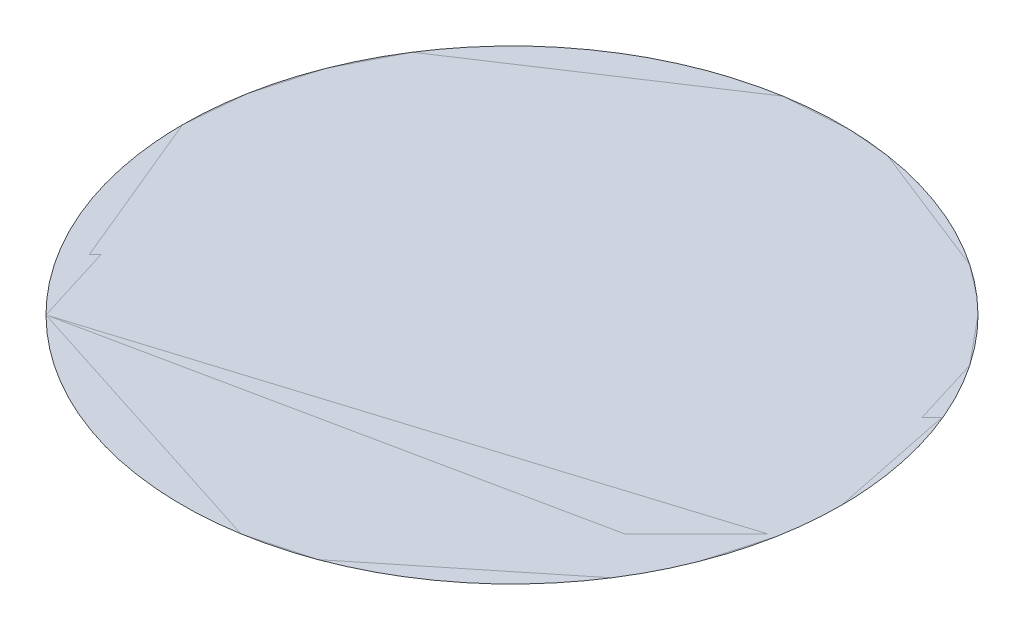
ISO-10303-21;
HEADER;
FILE_DESCRIPTION(('STEP AP214'),'2;1');
FILE_NAME('part.step','',(''),(''),'','','');
FILE_SCHEMA(('AUTOMOTIVE_DESIGN { 1 0 10303 214 1 1 1 1 }'));
ENDSEC;
DATA;
#1=APPLICATION_CONTEXT('core data for automotive mechanical design processes');
#2=APPLICATION_PROTOCOL_DEFINITION('international standard','automotive_design',2000,#1);
#3=PRODUCT_CONTEXT('',#1,'mechanical');
#4=PRODUCT('Part','Part','',(#3));
#5=PRODUCT_RELATED_PRODUCT_CATEGORY('part','',(#4));
#6=PRODUCT_DEFINITION_FORMATION('','',#4);
#7=PRODUCT_DEFINITION_CONTEXT('part definition',#1,'design');
#8=PRODUCT_DEFINITION('design','',#6,#7);
#9=PRODUCT_DEFINITION_SHAPE('','',#8);
#10=(LENGTH_UNIT() NAMED_UNIT(*) SI_UNIT(.MILLI.,.METRE.));
#11=(NAMED_UNIT(*) PLANE_ANGLE_UNIT() SI_UNIT($,.RADIAN.));
#12=(NAMED_UNIT(*) SI_UNIT($,.STERADIAN.) SOLID_ANGLE_UNIT());
#13=UNCERTAINTY_MEASURE_WITH_UNIT(LENGTH_MEASURE(1.E-05),#10,'distance_accuracy_value','');
#14=(GEOMETRIC_REPRESENTATION_CONTEXT(3) GLOBAL_UNCERTAINTY_ASSIGNED_CONTEXT((#13)) GLOBAL_UNIT_ASSIGNED_CONTEXT((#10,
#11,#12)) REPRESENTATION_CONTEXT('',''));
#15=CARTESIAN_POINT('',(0.,0.,0.));
#16=DIRECTION('',(0.,0.,1.));
#17=DIRECTION('',(1.,0.,0.));
#18=AXIS2_PLACEMENT_3D('',#15,#16,#17);
#19=CARTESIAN_POINT('',(-87.1938944299747,6665.77021823604,-843.24443456978));
#20=DIRECTION('',(0.,1.,0.));
#21=DIRECTION('',(0.,0.,1.));
#22=AXIS2_PLACEMENT_3D('',#19,#20,#21);
#23=PLANE('',#22);
#24=CARTESIAN_POINT('',(42.6421051830794,6665.77011823604,-843.24443456978));
#25=CARTESIAN_POINT('',(42.6420565264851,6665.77011823604,-839.332137268418));
#26=CARTESIAN_POINT('',(41.9302109471062,6665.77011823604,-835.485146949387));
#27=CARTESIAN_POINT('',(41.1754280509976,6665.77011823604,-831.406112705987));
#28=CARTESIAN_POINT('',(39.6481305319009,6665.77011823604,-827.548101247308));
#29=CARTESIAN_POINT('',(38.0570913561337,6665.77011823604,-823.529075946365));
#30=CARTESIAN_POINT('',(35.6912506271511,6665.77011823604,-819.910258708724));
#31=CARTESIAN_POINT('',(33.2752568842551,6665.77011823604,-816.214726843152));
#32=CARTESIAN_POINT('',(30.1525217390256,6665.77011823604,-813.091912830755));
#33=CARTESIAN_POINT('',(27.0305440216549,6665.77011823604,-809.969856265347));
#34=CARTESIAN_POINT('',(23.3341758610563,6665.77011823604,-807.553183942629));
#35=CARTESIAN_POINT('',(19.7162956767365,6665.77011823604,-805.187826778927));
#36=CARTESIAN_POINT('',(15.6963333224726,6665.77011823604,-803.59630403788));
#37=CARTESIAN_POINT('',(11.8393307534372,6665.77011823604,-802.069297872166));
#38=CARTESIAN_POINT('',(7.75928762039305,6665.77011823604,-801.314223622674));
#39=CARTESIAN_POINT('',(3.91283060734068,6665.77011823604,-800.602378049569));
#40=CARTESIAN_POINT('',(0.,6665.77011823604,-800.602329386701));
#41=CARTESIAN_POINT('',(-3.911771436574,6665.77011823604,-800.602280737005));
#42=CARTESIAN_POINT('',(-7.7592876203927,6665.77011823604,-801.314223622674));
#43=CARTESIAN_POINT('',(-11.838321867557,6665.77011823604,-802.069006519984));
#44=CARTESIAN_POINT('',(-15.6963333224723,6665.77011823604,-803.59630403788));
#45=CARTESIAN_POINT('',(-19.7153586248951,6665.77011823604,-805.187343214533));
#46=CARTESIAN_POINT('',(-23.3341758610561,6665.77011823604,-807.553183942629));
#47=CARTESIAN_POINT('',(-27.0297077254287,6665.77011823604,-809.969177684823));
#48=CARTESIAN_POINT('',(-30.1525217390254,6665.77011823604,-813.091912830755));
#49=CARTESIAN_POINT('',(-33.2745783049619,6665.77011823604,-816.213890548156));
#50=CARTESIAN_POINT('',(-35.691250627151,6665.77011823604,-819.910258708724));
#51=CARTESIAN_POINT('',(-38.0566077881226,6665.77011823604,-823.528138889628));
#52=CARTESIAN_POINT('',(-39.6481305319008,6665.77011823604,-827.548101247308));
#53=CARTESIAN_POINT('',(-41.1751366947974,6665.77011823604,-831.405103805887));
#54=CARTESIAN_POINT('',(-41.9302109471062,6665.77011823604,-835.485146949387));
#55=CARTESIAN_POINT('',(-42.6420565198524,6665.77011823604,-839.33160395601));
#56=CARTESIAN_POINT('',(-42.6421051830794,6665.77011823604,-843.24443456978));
#57=B_SPLINE_CURVE_WITH_KNOTS('',2,(#24,#25,#26,#27,#28,#29,#30,#31,#32,#33,#34,#35,#36,#37,#38,
#39,#40,#41,#42,#43,#44,#45,#46,#47,#48,#49,#50,#51,#52,#53,#54,#55,#56),.UNSPECIFIED.,.F.,.F.,
(3,2,2,2,2,2,2,2,2,2,2,2,2,2,2,2,3),(0.,0.0625,0.125,0.1875,0.25,0.3125,0.375,0.4375,0.5,0.5625,
0.625,0.6875,0.75,0.8125,0.875,0.9375,1.),.UNSPECIFIED.);
#58=CARTESIAN_POINT('',(42.6421051479061,6665.77016823604,-843.24443456978));
#59=VERTEX_POINT('',#58);
#60=CARTESIAN_POINT('',(-42.6421051479061,6665.77016823604,-843.24443456978));
#61=VERTEX_POINT('',#60);
#62=EDGE_CURVE('E28',#59,#61,#57,.T.);
#63=ORIENTED_EDGE('',*,*,#62,.F.);
#64=CARTESIAN_POINT('',(-42.6421051830794,6665.77011823604,-843.24443456978));
#65=CARTESIAN_POINT('',(-42.6420565264851,6665.77011823604,-847.156731872508));
#66=CARTESIAN_POINT('',(-41.9302109471062,6665.77011823604,-851.003722190173));
#67=CARTESIAN_POINT('',(-41.1754280502336,6665.77011823604,-855.082756436255));
#68=CARTESIAN_POINT('',(-39.6481305319009,6665.77011823604,-858.940767892252));
#69=CARTESIAN_POINT('',(-38.0570913556503,6665.77011823604,-862.959793193634));
#70=CARTESIAN_POINT('',(-35.6912506271511,6665.77011823604,-866.578610430837));
#71=CARTESIAN_POINT('',(-33.2752568851856,6665.77011823604,-870.274142295294));
#72=CARTESIAN_POINT('',(-30.1525217390255,6665.77011823604,-873.396956308806));
#73=CARTESIAN_POINT('',(-27.0305440213484,6665.77011823604,-876.519012874706));
#74=CARTESIAN_POINT('',(-23.3341758610562,6665.77011823604,-878.935685196932));
#75=CARTESIAN_POINT('',(-19.7162956827734,6665.77011823604,-881.301042356402));
#76=CARTESIAN_POINT('',(-15.6963333224724,6665.77011823604,-882.892565101681));
#77=CARTESIAN_POINT('',(-11.8393307659455,6665.77011823604,-884.41957126421));
#78=CARTESIAN_POINT('',(-7.75928762039287,6665.77011823604,-885.174645516887));
#79=CARTESIAN_POINT('',(-3.91283061619878,6665.77011823604,-885.886491089172));
#80=CARTESIAN_POINT('',(0.,6665.77011823604,-885.88653975286));
#81=CARTESIAN_POINT('',(3.91177143436823,6665.77011823604,-885.886588403375));
#82=CARTESIAN_POINT('',(7.75928762039284,6665.77011823604,-885.174645516887));
#83=CARTESIAN_POINT('',(11.8383218632229,6665.77011823604,-884.419862619943));
#84=CARTESIAN_POINT('',(15.6963333224724,6665.77011823604,-882.892565101681));
#85=CARTESIAN_POINT('',(19.7153586194432,6665.77011823604,-881.301525928592));
#86=CARTESIAN_POINT('',(23.3341758610562,6665.77011823604,-878.935685196932));
#87=CARTESIAN_POINT('',(27.0297077228808,6665.77011823604,-876.519691456403));
#88=CARTESIAN_POINT('',(30.1525217390254,6665.77011823604,-873.396956308806));
#89=CARTESIAN_POINT('',(33.274578300606,6665.77011823604,-870.274978596643));
#90=CARTESIAN_POINT('',(35.691250627151,6665.77011823604,-866.578610430837));
#91=CARTESIAN_POINT('',(38.0566077873368,6665.77011823604,-862.960730252529));
#92=CARTESIAN_POINT('',(39.6481305319008,6665.77011823604,-858.940767892252));
#93=CARTESIAN_POINT('',(41.1751366956576,6665.77011823604,-855.083765330914));
#94=CARTESIAN_POINT('',(41.9302109471062,6665.77011823604,-851.003722190173));
#95=CARTESIAN_POINT('',(42.6420565198524,6665.77011823604,-847.157265181768));
#96=CARTESIAN_POINT('',(42.6421051830794,6665.77011823604,-843.24443456978));
#97=B_SPLINE_CURVE_WITH_KNOTS('',2,(#64,#65,#66,#67,#68,#69,#70,#71,#72,#73,#74,#75,#76,#77,#78,
#79,#80,#81,#82,#83,#84,#85,#86,#87,#88,#89,#90,#91,#92,#93,#94,#95,#96),.UNSPECIFIED.,.F.,.F.,
(3,2,2,2,2,2,2,2,2,2,2,2,2,2,2,2,3),(0.,0.0625,0.125,0.1875,0.25,0.3125,0.375,0.4375,0.5,0.5625,
0.625,0.6875,0.75,0.8125,0.875,0.9375,1.),.UNSPECIFIED.);
#98=EDGE_CURVE('E11',#61,#59,#97,.T.);
#99=ORIENTED_EDGE('',*,*,#98,.F.);
#100=EDGE_LOOP('',(#63,#99));
#101=FACE_BOUND('',#100,.T.);
#102=ADVANCED_FACE('F16',(#101),#23,.T.);
#103=CARTESIAN_POINT('',(0.,6665.77011823604,-756.050539996299));
#104=DIRECTION('',(0.,-1.,0.));
#105=DIRECTION('',(0.,0.,-1.));
#106=AXIS2_PLACEMENT_3D('',#103,#104,#105);
#107=PLANE('',#106);
#108=ORIENTED_EDGE('',*,*,#62,.T.);
#109=ORIENTED_EDGE('',*,*,#98,.T.);
#110=EDGE_LOOP('',(#108,#109));
#111=FACE_BOUND('',#110,.T.);
#112=ADVANCED_FACE('F18',(#111),#107,.T.);
#113=CLOSED_SHELL('',(#102,#112));
#114=MANIFOLD_SOLID_BREP('B1',#113);
#115=ADVANCED_BREP_SHAPE_REPRESENTATION('',(#18,#114),#14);
#116=SHAPE_DEFINITION_REPRESENTATION(#9,#115);
ENDSEC;
END-ISO-10303-21;
